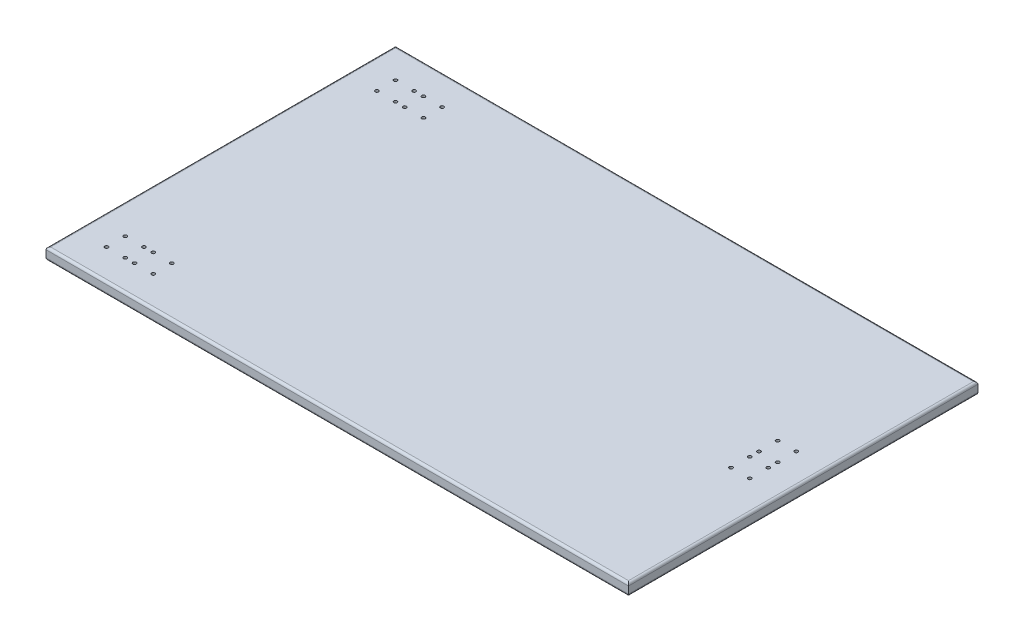
ISO-10303-21;
HEADER;
FILE_DESCRIPTION(('STEP AP214'),'2;1');
FILE_NAME('part.step','',(''),(''),'','','');
FILE_SCHEMA(('AUTOMOTIVE_DESIGN { 1 0 10303 214 1 1 1 1 }'));
ENDSEC;
DATA;
#1=APPLICATION_CONTEXT('core data for automotive mechanical design processes');
#2=APPLICATION_PROTOCOL_DEFINITION('international standard','automotive_design',2000,#1);
#3=PRODUCT_CONTEXT('',#1,'mechanical');
#4=PRODUCT('Part','Part','',(#3));
#5=PRODUCT_RELATED_PRODUCT_CATEGORY('part','',(#4));
#6=PRODUCT_DEFINITION_FORMATION('','',#4);
#7=PRODUCT_DEFINITION_CONTEXT('part definition',#1,'design');
#8=PRODUCT_DEFINITION('design','',#6,#7);
#9=PRODUCT_DEFINITION_SHAPE('','',#8);
#10=(LENGTH_UNIT() NAMED_UNIT(*) SI_UNIT(.MILLI.,.METRE.));
#11=(NAMED_UNIT(*) PLANE_ANGLE_UNIT() SI_UNIT($,.RADIAN.));
#12=(NAMED_UNIT(*) SI_UNIT($,.STERADIAN.) SOLID_ANGLE_UNIT());
#13=UNCERTAINTY_MEASURE_WITH_UNIT(LENGTH_MEASURE(1.E-05),#10,'distance_accuracy_value','');
#14=(GEOMETRIC_REPRESENTATION_CONTEXT(3) GLOBAL_UNCERTAINTY_ASSIGNED_CONTEXT((#13)) GLOBAL_UNIT_ASSIGNED_CONTEXT((#10,
#11,#12)) REPRESENTATION_CONTEXT('',''));
#15=CARTESIAN_POINT('',(0.,0.,0.));
#16=DIRECTION('',(0.,0.,1.));
#17=DIRECTION('',(1.,0.,0.));
#18=AXIS2_PLACEMENT_3D('',#15,#16,#17);
#19=CARTESIAN_POINT('',(-1250.,50.,750.));
#20=DIRECTION('',(1.,0.,0.));
#21=DIRECTION('',(0.,0.,-1.));
#22=AXIS2_PLACEMENT_3D('',#19,#20,#21);
#23=PLANE('',#22);
#24=DIRECTION('',(0.,-1.,0.));
#25=VECTOR('',#24,1.);
#26=CARTESIAN_POINT('',(-1250.,50.,-750.));
#27=LINE('',#26,#25);
#28=CARTESIAN_POINT('',(-1250.,40.,-750.));
#29=VERTEX_POINT('',#28);
#30=CARTESIAN_POINT('',(-1250.,10.,-750.));
#31=VERTEX_POINT('',#30);
#32=EDGE_CURVE('E145',#29,#31,#27,.T.);
#33=ORIENTED_EDGE('',*,*,#32,.T.);
#34=DIRECTION('',(0.,0.,1.));
#35=VECTOR('',#34,1.);
#36=CARTESIAN_POINT('',(-1250.,10.,750.));
#37=LINE('',#36,#35);
#38=CARTESIAN_POINT('',(-1250.,10.,750.));
#39=VERTEX_POINT('',#38);
#40=EDGE_CURVE('E11',#31,#39,#37,.T.);
#41=ORIENTED_EDGE('',*,*,#40,.T.);
#42=DIRECTION('',(0.,-1.,0.));
#43=VECTOR('',#42,1.);
#44=CARTESIAN_POINT('',(-1250.,50.,750.));
#45=LINE('',#44,#43);
#46=CARTESIAN_POINT('',(-1250.,40.,750.));
#47=VERTEX_POINT('',#46);
#48=EDGE_CURVE('E122',#47,#39,#45,.T.);
#49=ORIENTED_EDGE('',*,*,#48,.F.);
#50=DIRECTION('',(0.,0.,1.));
#51=VECTOR('',#50,1.);
#52=CARTESIAN_POINT('',(-1250.,40.,-750.));
#53=LINE('',#52,#51);
#54=EDGE_CURVE('E137',#47,#29,#53,.F.);
#55=ORIENTED_EDGE('',*,*,#54,.T.);
#56=EDGE_LOOP('',(#33,#41,#49,#55));
#57=FACE_BOUND('',#56,.T.);
#58=ADVANCED_FACE('F34',(#57),#23,.F.);
#59=CARTESIAN_POINT('',(1250.,50.,750.));
#60=DIRECTION('',(0.,0.,-1.));
#61=DIRECTION('',(-1.,0.,0.));
#62=AXIS2_PLACEMENT_3D('',#59,#60,#61);
#63=PLANE('',#62);
#64=ORIENTED_EDGE('',*,*,#48,.T.);
#65=DIRECTION('',(1.,0.,0.));
#66=VECTOR('',#65,1.);
#67=CARTESIAN_POINT('',(1250.,10.,750.));
#68=LINE('',#67,#66);
#69=CARTESIAN_POINT('',(1250.,10.,750.));
#70=VERTEX_POINT('',#69);
#71=EDGE_CURVE('E138',#39,#70,#68,.T.);
#72=ORIENTED_EDGE('',*,*,#71,.T.);
#73=DIRECTION('',(0.,-1.,0.));
#74=VECTOR('',#73,1.);
#75=CARTESIAN_POINT('',(1250.,50.,750.));
#76=LINE('',#75,#74);
#77=CARTESIAN_POINT('',(1250.,40.,750.));
#78=VERTEX_POINT('',#77);
#79=EDGE_CURVE('E189',#78,#70,#76,.T.);
#80=ORIENTED_EDGE('',*,*,#79,.F.);
#81=DIRECTION('',(1.,0.,0.));
#82=VECTOR('',#81,1.);
#83=CARTESIAN_POINT('',(-1250.,40.,750.));
#84=LINE('',#83,#82);
#85=EDGE_CURVE('E135',#78,#47,#84,.F.);
#86=ORIENTED_EDGE('',*,*,#85,.T.);
#87=EDGE_LOOP('',(#64,#72,#80,#86));
#88=FACE_BOUND('',#87,.T.);
#89=ADVANCED_FACE('F188',(#88),#63,.F.);
#90=CARTESIAN_POINT('',(1250.,50.,750.));
#91=DIRECTION('',(-1.,0.,0.));
#92=DIRECTION('',(0.,0.,1.));
#93=AXIS2_PLACEMENT_3D('',#90,#91,#92);
#94=PLANE('',#93);
#95=ORIENTED_EDGE('',*,*,#79,.T.);
#96=DIRECTION('',(0.,0.,-1.));
#97=VECTOR('',#96,1.);
#98=CARTESIAN_POINT('',(1250.,10.,750.));
#99=LINE('',#98,#97);
#100=CARTESIAN_POINT('',(1250.,10.,-750.));
#101=VERTEX_POINT('',#100);
#102=EDGE_CURVE('E58',#70,#101,#99,.T.);
#103=ORIENTED_EDGE('',*,*,#102,.T.);
#104=DIRECTION('',(0.,-1.,0.));
#105=VECTOR('',#104,1.);
#106=CARTESIAN_POINT('',(1250.,50.,-750.));
#107=LINE('',#106,#105);
#108=CARTESIAN_POINT('',(1250.,40.,-750.));
#109=VERTEX_POINT('',#108);
#110=EDGE_CURVE('E194',#109,#101,#107,.T.);
#111=ORIENTED_EDGE('',*,*,#110,.F.);
#112=DIRECTION('',(0.,0.,-1.));
#113=VECTOR('',#112,1.);
#114=CARTESIAN_POINT('',(1250.,40.,750.));
#115=LINE('',#114,#113);
#116=EDGE_CURVE('E129',#109,#78,#115,.F.);
#117=ORIENTED_EDGE('',*,*,#116,.T.);
#118=EDGE_LOOP('',(#95,#103,#111,#117));
#119=FACE_BOUND('',#118,.T.);
#120=ADVANCED_FACE('F192',(#119),#94,.F.);
#121=CARTESIAN_POINT('',(1250.,50.,-750.));
#122=DIRECTION('',(0.,0.,1.));
#123=DIRECTION('',(1.,0.,0.));
#124=AXIS2_PLACEMENT_3D('',#121,#122,#123);
#125=PLANE('',#124);
#126=ORIENTED_EDGE('',*,*,#110,.T.);
#127=DIRECTION('',(-1.,0.,0.));
#128=VECTOR('',#127,1.);
#129=CARTESIAN_POINT('',(1250.,10.,-750.));
#130=LINE('',#129,#128);
#131=EDGE_CURVE('E43',#101,#31,#130,.T.);
#132=ORIENTED_EDGE('',*,*,#131,.T.);
#133=ORIENTED_EDGE('',*,*,#32,.F.);
#134=DIRECTION('',(-1.,0.,0.));
#135=VECTOR('',#134,1.);
#136=CARTESIAN_POINT('',(1250.,40.,-750.));
#137=LINE('',#136,#135);
#138=EDGE_CURVE('E109',#29,#109,#137,.F.);
#139=ORIENTED_EDGE('',*,*,#138,.T.);
#140=EDGE_LOOP('',(#126,#132,#133,#139));
#141=FACE_BOUND('',#140,.T.);
#142=ADVANCED_FACE('F204',(#141),#125,.F.);
#143=CARTESIAN_POINT('',(0.,50.,0.));
#144=DIRECTION('',(0.,1.,0.));
#145=DIRECTION('',(0.,0.,1.));
#146=AXIS2_PLACEMENT_3D('',#143,#144,#145);
#147=PLANE('',#146);
#148=CARTESIAN_POINT('',(-919.999999999999,50.,620.));
#149=DIRECTION('',(0.,-1.,0.));
#150=DIRECTION('',(0.,0.,-1.));
#151=AXIS2_PLACEMENT_3D('',#148,#149,#150);
#152=CIRCLE('',#151,7.24999999999993);
#153=CARTESIAN_POINT('',(-919.999999999999,50.,612.75));
#154=VERTEX_POINT('',#153);
#155=EDGE_CURVE('E288',#154,#154,#152,.T.);
#156=ORIENTED_EDGE('',*,*,#155,.T.);
#157=EDGE_LOOP('',(#156));
#158=FACE_BOUND('',#157,.T.);
#159=CARTESIAN_POINT('',(-919.999999999999,50.,-540.));
#160=DIRECTION('',(0.,-1.,0.));
#161=DIRECTION('',(0.,0.,-1.));
#162=AXIS2_PLACEMENT_3D('',#159,#160,#161);
#163=CIRCLE('',#162,7.24999999999993);
#164=CARTESIAN_POINT('',(-919.999999999999,50.,-547.25));
#165=VERTEX_POINT('',#164);
#166=EDGE_CURVE('E295',#165,#165,#163,.T.);
#167=ORIENTED_EDGE('',*,*,#166,.T.);
#168=EDGE_LOOP('',(#167));
#169=FACE_BOUND('',#168,.T.);
#170=CARTESIAN_POINT('',(-1000.,50.,-540.));
#171=DIRECTION('',(0.,-1.,0.));
#172=DIRECTION('',(0.,0.,1.));
#173=AXIS2_PLACEMENT_3D('',#170,#171,#172);
#174=CIRCLE('',#173,7.24999999999993);
#175=CARTESIAN_POINT('',(-1000.,50.,-532.75));
#176=VERTEX_POINT('',#175);
#177=EDGE_CURVE('E301',#176,#176,#174,.T.);
#178=ORIENTED_EDGE('',*,*,#177,.T.);
#179=EDGE_LOOP('',(#178));
#180=FACE_BOUND('',#179,.T.);
#181=CARTESIAN_POINT('',(-1000.,50.,-620.));
#182=DIRECTION('',(0.,-1.,0.));
#183=DIRECTION('',(0.,0.,-1.));
#184=AXIS2_PLACEMENT_3D('',#181,#182,#183);
#185=CIRCLE('',#184,7.24999999999993);
#186=CARTESIAN_POINT('',(-1000.,50.,-627.25));
#187=VERTEX_POINT('',#186);
#188=EDGE_CURVE('E277',#187,#187,#185,.T.);
#189=ORIENTED_EDGE('',*,*,#188,.T.);
#190=EDGE_LOOP('',(#189));
#191=FACE_BOUND('',#190,.T.);
#192=CARTESIAN_POINT('',(-1040.,50.,-620.));
#193=DIRECTION('',(0.,-1.,0.));
#194=DIRECTION('',(0.,0.,1.));
#195=AXIS2_PLACEMENT_3D('',#192,#193,#194);
#196=CIRCLE('',#195,7.24999999999993);
#197=CARTESIAN_POINT('',(-1040.,50.,-612.75));
#198=VERTEX_POINT('',#197);
#199=EDGE_CURVE('E258',#198,#198,#196,.T.);
#200=ORIENTED_EDGE('',*,*,#199,.T.);
#201=EDGE_LOOP('',(#200));
#202=FACE_BOUND('',#201,.T.);
#203=CARTESIAN_POINT('',(-1040.,50.,-540.));
#204=DIRECTION('',(0.,-1.,0.));
#205=DIRECTION('',(0.,0.,-1.));
#206=AXIS2_PLACEMENT_3D('',#203,#204,#205);
#207=CIRCLE('',#206,7.24999999999993);
#208=CARTESIAN_POINT('',(-1040.,50.,-547.25));
#209=VERTEX_POINT('',#208);
#210=EDGE_CURVE('E264',#209,#209,#207,.T.);
#211=ORIENTED_EDGE('',*,*,#210,.T.);
#212=EDGE_LOOP('',(#211));
#213=FACE_BOUND('',#212,.T.);
#214=CARTESIAN_POINT('',(-1120.,50.,-540.));
#215=DIRECTION('',(0.,-1.,0.));
#216=DIRECTION('',(0.,0.,1.));
#217=AXIS2_PLACEMENT_3D('',#214,#215,#216);
#218=CIRCLE('',#217,7.24999999999993);
#219=CARTESIAN_POINT('',(-1120.,50.,-532.75));
#220=VERTEX_POINT('',#219);
#221=EDGE_CURVE('E265',#220,#220,#218,.T.);
#222=ORIENTED_EDGE('',*,*,#221,.T.);
#223=EDGE_LOOP('',(#222));
#224=FACE_BOUND('',#223,.T.);
#225=CARTESIAN_POINT('',(-919.999999999999,50.,-620.));
#226=DIRECTION('',(0.,-1.,0.));
#227=DIRECTION('',(0.,0.,1.));
#228=AXIS2_PLACEMENT_3D('',#225,#226,#227);
#229=CIRCLE('',#228,7.24999999999993);
#230=CARTESIAN_POINT('',(-919.999999999999,50.,-612.75));
#231=VERTEX_POINT('',#230);
#232=EDGE_CURVE('E276',#231,#231,#229,.T.);
#233=ORIENTED_EDGE('',*,*,#232,.T.);
#234=EDGE_LOOP('',(#233));
#235=FACE_BOUND('',#234,.T.);
#236=CARTESIAN_POINT('',(-1120.,50.,620.));
#237=DIRECTION('',(0.,-1.,0.));
#238=DIRECTION('',(0.,0.,1.));
#239=AXIS2_PLACEMENT_3D('',#236,#237,#238);
#240=CIRCLE('',#239,7.24999999999993);
#241=CARTESIAN_POINT('',(-1120.,50.,627.25));
#242=VERTEX_POINT('',#241);
#243=EDGE_CURVE('E336',#242,#242,#240,.T.);
#244=ORIENTED_EDGE('',*,*,#243,.T.);
#245=EDGE_LOOP('',(#244));
#246=FACE_BOUND('',#245,.T.);
#247=CARTESIAN_POINT('',(-1120.,50.,540.));
#248=DIRECTION('',(0.,-1.,0.));
#249=DIRECTION('',(0.,0.,-1.));
#250=AXIS2_PLACEMENT_3D('',#247,#248,#249);
#251=CIRCLE('',#250,7.24999999999993);
#252=CARTESIAN_POINT('',(-1120.,50.,532.75));
#253=VERTEX_POINT('',#252);
#254=EDGE_CURVE('E342',#253,#253,#251,.T.);
#255=ORIENTED_EDGE('',*,*,#254,.T.);
#256=EDGE_LOOP('',(#255));
#257=FACE_BOUND('',#256,.T.);
#258=CARTESIAN_POINT('',(-1040.,50.,540.));
#259=DIRECTION('',(0.,-1.,0.));
#260=DIRECTION('',(0.,0.,1.));
#261=AXIS2_PLACEMENT_3D('',#258,#259,#260);
#262=CIRCLE('',#261,7.24999999999993);
#263=CARTESIAN_POINT('',(-1040.,50.,547.25));
#264=VERTEX_POINT('',#263);
#265=EDGE_CURVE('E313',#264,#264,#262,.T.);
#266=ORIENTED_EDGE('',*,*,#265,.T.);
#267=EDGE_LOOP('',(#266));
#268=FACE_BOUND('',#267,.T.);
#269=CARTESIAN_POINT('',(-1040.,50.,620.));
#270=DIRECTION('',(0.,-1.,0.));
#271=DIRECTION('',(0.,0.,-1.));
#272=AXIS2_PLACEMENT_3D('',#269,#270,#271);
#273=CIRCLE('',#272,7.24999999999993);
#274=CARTESIAN_POINT('',(-1040.,50.,612.75));
#275=VERTEX_POINT('',#274);
#276=EDGE_CURVE('E312',#275,#275,#273,.T.);
#277=ORIENTED_EDGE('',*,*,#276,.T.);
#278=EDGE_LOOP('',(#277));
#279=FACE_BOUND('',#278,.T.);
#280=CARTESIAN_POINT('',(-1000.,50.,620.));
#281=DIRECTION('',(0.,-1.,0.));
#282=DIRECTION('',(0.,0.,1.));
#283=AXIS2_PLACEMENT_3D('',#280,#281,#282);
#284=CIRCLE('',#283,7.24999999999993);
#285=CARTESIAN_POINT('',(-1000.,50.,627.25));
#286=VERTEX_POINT('',#285);
#287=EDGE_CURVE('E319',#286,#286,#284,.T.);
#288=ORIENTED_EDGE('',*,*,#287,.T.);
#289=EDGE_LOOP('',(#288));
#290=FACE_BOUND('',#289,.T.);
#291=CARTESIAN_POINT('',(-1000.,50.,540.));
#292=DIRECTION('',(0.,-1.,0.));
#293=DIRECTION('',(0.,0.,-1.));
#294=AXIS2_PLACEMENT_3D('',#291,#292,#293);
#295=CIRCLE('',#294,7.24999999999993);
#296=CARTESIAN_POINT('',(-1000.,50.,532.75));
#297=VERTEX_POINT('',#296);
#298=EDGE_CURVE('E325',#297,#297,#295,.T.);
#299=ORIENTED_EDGE('',*,*,#298,.T.);
#300=EDGE_LOOP('',(#299));
#301=FACE_BOUND('',#300,.T.);
#302=CARTESIAN_POINT('',(-919.999999999999,50.,540.));
#303=DIRECTION('',(0.,-1.,0.));
#304=DIRECTION('',(0.,0.,1.));
#305=AXIS2_PLACEMENT_3D('',#302,#303,#304);
#306=CIRCLE('',#305,7.24999999999993);
#307=CARTESIAN_POINT('',(-919.999999999999,50.,547.25));
#308=VERTEX_POINT('',#307);
#309=EDGE_CURVE('E289',#308,#308,#306,.T.);
#310=ORIENTED_EDGE('',*,*,#309,.T.);
#311=EDGE_LOOP('',(#310));
#312=FACE_BOUND('',#311,.T.);
#313=CARTESIAN_POINT('',(-1120.,50.,-620.));
#314=DIRECTION('',(0.,-1.,0.));
#315=DIRECTION('',(0.,0.,-1.));
#316=AXIS2_PLACEMENT_3D('',#313,#314,#315);
#317=CIRCLE('',#316,7.24999999999993);
#318=CARTESIAN_POINT('',(-1120.,50.,-627.25));
#319=VERTEX_POINT('',#318);
#320=EDGE_CURVE('E217',#319,#319,#317,.T.);
#321=ORIENTED_EDGE('',*,*,#320,.T.);
#322=EDGE_LOOP('',(#321));
#323=FACE_BOUND('',#322,.T.);
#324=CARTESIAN_POINT('',(1040.,50.,100.));
#325=DIRECTION('',(0.,-1.,0.));
#326=DIRECTION('',(0.,0.,-1.));
#327=AXIS2_PLACEMENT_3D('',#324,#325,#326);
#328=CIRCLE('',#327,7.24999999999994);
#329=CARTESIAN_POINT('',(1040.,50.,92.7500000000001));
#330=VERTEX_POINT('',#329);
#331=EDGE_CURVE('E216',#330,#330,#328,.T.);
#332=ORIENTED_EDGE('',*,*,#331,.T.);
#333=EDGE_LOOP('',(#332));
#334=FACE_BOUND('',#333,.T.);
#335=CARTESIAN_POINT('',(1040.,50.,20.));
#336=DIRECTION('',(0.,-1.,0.));
#337=DIRECTION('',(0.,0.,1.));
#338=AXIS2_PLACEMENT_3D('',#335,#336,#337);
#339=CIRCLE('',#338,7.24999999999994);
#340=CARTESIAN_POINT('',(1040.,50.,27.2499999999999));
#341=VERTEX_POINT('',#340);
#342=EDGE_CURVE('E223',#341,#341,#339,.T.);
#343=ORIENTED_EDGE('',*,*,#342,.T.);
#344=EDGE_LOOP('',(#343));
#345=FACE_BOUND('',#344,.T.);
#346=CARTESIAN_POINT('',(1120.,50.,20.));
#347=DIRECTION('',(0.,-1.,0.));
#348=DIRECTION('',(0.,0.,-1.));
#349=AXIS2_PLACEMENT_3D('',#346,#347,#348);
#350=CIRCLE('',#349,7.24999999999994);
#351=CARTESIAN_POINT('',(1120.,50.,12.7500000000001));
#352=VERTEX_POINT('',#351);
#353=EDGE_CURVE('E229',#352,#352,#350,.T.);
#354=ORIENTED_EDGE('',*,*,#353,.T.);
#355=EDGE_LOOP('',(#354));
#356=FACE_BOUND('',#355,.T.);
#357=CARTESIAN_POINT('',(1120.,50.,-20.));
#358=DIRECTION('',(0.,-1.,0.));
#359=DIRECTION('',(0.,0.,1.));
#360=AXIS2_PLACEMENT_3D('',#357,#358,#359);
#361=CIRCLE('',#360,7.24999999999994);
#362=CARTESIAN_POINT('',(1120.,50.,-12.7500000000001));
#363=VERTEX_POINT('',#362);
#364=EDGE_CURVE('E235',#363,#363,#361,.T.);
#365=ORIENTED_EDGE('',*,*,#364,.T.);
#366=EDGE_LOOP('',(#365));
#367=FACE_BOUND('',#366,.T.);
#368=CARTESIAN_POINT('',(1040.,50.,-20.));
#369=DIRECTION('',(0.,-1.,0.));
#370=DIRECTION('',(0.,0.,-1.));
#371=AXIS2_PLACEMENT_3D('',#368,#369,#370);
#372=CIRCLE('',#371,7.24999999999994);
#373=CARTESIAN_POINT('',(1040.,50.,-27.2499999999999));
#374=VERTEX_POINT('',#373);
#375=EDGE_CURVE('E241',#374,#374,#372,.T.);
#376=ORIENTED_EDGE('',*,*,#375,.T.);
#377=EDGE_LOOP('',(#376));
#378=FACE_BOUND('',#377,.T.);
#379=CARTESIAN_POINT('',(1040.,50.,-100.));
#380=DIRECTION('',(0.,-1.,0.));
#381=DIRECTION('',(0.,0.,1.));
#382=AXIS2_PLACEMENT_3D('',#379,#380,#381);
#383=CIRCLE('',#382,7.24999999999994);
#384=CARTESIAN_POINT('',(1040.,50.,-92.7500000000001));
#385=VERTEX_POINT('',#384);
#386=EDGE_CURVE('E247',#385,#385,#383,.T.);
#387=ORIENTED_EDGE('',*,*,#386,.T.);
#388=EDGE_LOOP('',(#387));
#389=FACE_BOUND('',#388,.T.);
#390=CARTESIAN_POINT('',(1120.,50.,-100.));
#391=DIRECTION('',(0.,-1.,0.));
#392=DIRECTION('',(0.,0.,-1.));
#393=AXIS2_PLACEMENT_3D('',#390,#391,#392);
#394=CIRCLE('',#393,7.24999999999994);
#395=CARTESIAN_POINT('',(1120.,50.,-107.25));
#396=VERTEX_POINT('',#395);
#397=EDGE_CURVE('E210',#396,#396,#394,.T.);
#398=ORIENTED_EDGE('',*,*,#397,.T.);
#399=EDGE_LOOP('',(#398));
#400=FACE_BOUND('',#399,.T.);
#401=CARTESIAN_POINT('',(1120.,50.,100.));
#402=DIRECTION('',(0.,-1.,0.));
#403=DIRECTION('',(0.,0.,1.));
#404=AXIS2_PLACEMENT_3D('',#401,#402,#403);
#405=CIRCLE('',#404,7.24999999999994);
#406=CARTESIAN_POINT('',(1120.,50.,107.25));
#407=VERTEX_POINT('',#406);
#408=EDGE_CURVE('E162',#407,#407,#405,.T.);
#409=ORIENTED_EDGE('',*,*,#408,.T.);
#410=EDGE_LOOP('',(#409));
#411=FACE_BOUND('',#410,.T.);
#412=DIRECTION('',(0.,0.,-1.));
#413=VECTOR('',#412,1.);
#414=CARTESIAN_POINT('',(1240.,50.,-750.));
#415=LINE('',#414,#413);
#416=CARTESIAN_POINT('',(1240.,50.,740.));
#417=VERTEX_POINT('',#416);
#418=CARTESIAN_POINT('',(1240.,50.,-740.));
#419=VERTEX_POINT('',#418);
#420=EDGE_CURVE('E126',#417,#419,#415,.T.);
#421=ORIENTED_EDGE('',*,*,#420,.T.);
#422=DIRECTION('',(-1.,0.,0.));
#423=VECTOR('',#422,1.);
#424=CARTESIAN_POINT('',(-1250.,50.,-740.));
#425=LINE('',#424,#423);
#426=CARTESIAN_POINT('',(-1240.,50.,-740.));
#427=VERTEX_POINT('',#426);
#428=EDGE_CURVE('E107',#419,#427,#425,.T.);
#429=ORIENTED_EDGE('',*,*,#428,.T.);
#430=DIRECTION('',(0.,0.,1.));
#431=VECTOR('',#430,1.);
#432=CARTESIAN_POINT('',(-1240.,50.,750.));
#433=LINE('',#432,#431);
#434=CARTESIAN_POINT('',(-1240.,50.,740.));
#435=VERTEX_POINT('',#434);
#436=EDGE_CURVE('E115',#427,#435,#433,.T.);
#437=ORIENTED_EDGE('',*,*,#436,.T.);
#438=DIRECTION('',(1.,0.,0.));
#439=VECTOR('',#438,1.);
#440=CARTESIAN_POINT('',(1250.,50.,740.));
#441=LINE('',#440,#439);
#442=EDGE_CURVE('E121',#435,#417,#441,.T.);
#443=ORIENTED_EDGE('',*,*,#442,.T.);
#444=EDGE_LOOP('',(#421,#429,#437,#443));
#445=FACE_BOUND('',#444,.T.);
#446=ADVANCED_FACE('F124',(#158,#169,#180,#191,#202,#213,#224,#235,#246,#257,#268,#279,#290,
#301,#312,#323,#334,#345,#356,#367,#378,#389,#400,#411,#445),#147,.T.);
#447=CARTESIAN_POINT('',(0.,0.,0.));
#448=DIRECTION('',(0.,1.,0.));
#449=DIRECTION('',(0.,0.,1.));
#450=AXIS2_PLACEMENT_3D('',#447,#448,#449);
#451=PLANE('',#450);
#452=CARTESIAN_POINT('',(-919.999999999999,0.,620.));
#453=DIRECTION('',(0.,-1.,0.));
#454=DIRECTION('',(0.,0.,-1.));
#455=AXIS2_PLACEMENT_3D('',#452,#453,#454);
#456=CIRCLE('',#455,7.24999999999993);
#457=CARTESIAN_POINT('',(-919.999999999999,0.,612.75));
#458=VERTEX_POINT('',#457);
#459=EDGE_CURVE('E285',#458,#458,#456,.T.);
#460=ORIENTED_EDGE('',*,*,#459,.F.);
#461=EDGE_LOOP('',(#460));
#462=FACE_BOUND('',#461,.T.);
#463=CARTESIAN_POINT('',(-919.999999999999,0.,-540.));
#464=DIRECTION('',(0.,-1.,0.));
#465=DIRECTION('',(0.,0.,-1.));
#466=AXIS2_PLACEMENT_3D('',#463,#464,#465);
#467=CIRCLE('',#466,7.24999999999993);
#468=CARTESIAN_POINT('',(-919.999999999999,0.,-547.25));
#469=VERTEX_POINT('',#468);
#470=EDGE_CURVE('E292',#469,#469,#467,.T.);
#471=ORIENTED_EDGE('',*,*,#470,.F.);
#472=EDGE_LOOP('',(#471));
#473=FACE_BOUND('',#472,.T.);
#474=CARTESIAN_POINT('',(-1000.,0.,-540.));
#475=DIRECTION('',(0.,-1.,0.));
#476=DIRECTION('',(0.,0.,1.));
#477=AXIS2_PLACEMENT_3D('',#474,#475,#476);
#478=CIRCLE('',#477,7.24999999999993);
#479=CARTESIAN_POINT('',(-1000.,0.,-532.75));
#480=VERTEX_POINT('',#479);
#481=EDGE_CURVE('E298',#480,#480,#478,.T.);
#482=ORIENTED_EDGE('',*,*,#481,.F.);
#483=EDGE_LOOP('',(#482));
#484=FACE_BOUND('',#483,.T.);
#485=CARTESIAN_POINT('',(-1000.,0.,-620.));
#486=DIRECTION('',(0.,-1.,0.));
#487=DIRECTION('',(0.,0.,-1.));
#488=AXIS2_PLACEMENT_3D('',#485,#486,#487);
#489=CIRCLE('',#488,7.24999999999993);
#490=CARTESIAN_POINT('',(-1000.,0.,-627.25));
#491=VERTEX_POINT('',#490);
#492=EDGE_CURVE('E304',#491,#491,#489,.T.);
#493=ORIENTED_EDGE('',*,*,#492,.F.);
#494=EDGE_LOOP('',(#493));
#495=FACE_BOUND('',#494,.T.);
#496=CARTESIAN_POINT('',(-1040.,0.,-620.));
#497=DIRECTION('',(0.,-1.,0.));
#498=DIRECTION('',(0.,0.,1.));
#499=AXIS2_PLACEMENT_3D('',#496,#497,#498);
#500=CIRCLE('',#499,7.24999999999993);
#501=CARTESIAN_POINT('',(-1040.,0.,-612.75));
#502=VERTEX_POINT('',#501);
#503=EDGE_CURVE('E268',#502,#502,#500,.T.);
#504=ORIENTED_EDGE('',*,*,#503,.F.);
#505=EDGE_LOOP('',(#504));
#506=FACE_BOUND('',#505,.T.);
#507=CARTESIAN_POINT('',(-1040.,0.,-540.));
#508=DIRECTION('',(0.,-1.,0.));
#509=DIRECTION('',(0.,0.,-1.));
#510=AXIS2_PLACEMENT_3D('',#507,#508,#509);
#511=CIRCLE('',#510,7.24999999999993);
#512=CARTESIAN_POINT('',(-1040.,0.,-547.25));
#513=VERTEX_POINT('',#512);
#514=EDGE_CURVE('E261',#513,#513,#511,.T.);
#515=ORIENTED_EDGE('',*,*,#514,.F.);
#516=EDGE_LOOP('',(#515));
#517=FACE_BOUND('',#516,.T.);
#518=CARTESIAN_POINT('',(-1120.,0.,-540.));
#519=DIRECTION('',(0.,-1.,0.));
#520=DIRECTION('',(0.,0.,1.));
#521=AXIS2_PLACEMENT_3D('',#518,#519,#520);
#522=CIRCLE('',#521,7.24999999999993);
#523=CARTESIAN_POINT('',(-1120.,0.,-532.75));
#524=VERTEX_POINT('',#523);
#525=EDGE_CURVE('E280',#524,#524,#522,.T.);
#526=ORIENTED_EDGE('',*,*,#525,.F.);
#527=EDGE_LOOP('',(#526));
#528=FACE_BOUND('',#527,.T.);
#529=CARTESIAN_POINT('',(-919.999999999999,0.,-620.));
#530=DIRECTION('',(0.,-1.,0.));
#531=DIRECTION('',(0.,0.,1.));
#532=AXIS2_PLACEMENT_3D('',#529,#530,#531);
#533=CIRCLE('',#532,7.24999999999993);
#534=CARTESIAN_POINT('',(-919.999999999999,0.,-612.75));
#535=VERTEX_POINT('',#534);
#536=EDGE_CURVE('E273',#535,#535,#533,.T.);
#537=ORIENTED_EDGE('',*,*,#536,.F.);
#538=EDGE_LOOP('',(#537));
#539=FACE_BOUND('',#538,.T.);
#540=CARTESIAN_POINT('',(-1120.,0.,620.));
#541=DIRECTION('',(0.,-1.,0.));
#542=DIRECTION('',(0.,0.,1.));
#543=AXIS2_PLACEMENT_3D('',#540,#541,#542);
#544=CIRCLE('',#543,7.24999999999993);
#545=CARTESIAN_POINT('',(-1120.,0.,627.25));
#546=VERTEX_POINT('',#545);
#547=EDGE_CURVE('E333',#546,#546,#544,.T.);
#548=ORIENTED_EDGE('',*,*,#547,.F.);
#549=EDGE_LOOP('',(#548));
#550=FACE_BOUND('',#549,.T.);
#551=CARTESIAN_POINT('',(-1120.,0.,540.));
#552=DIRECTION('',(0.,-1.,0.));
#553=DIRECTION('',(0.,0.,-1.));
#554=AXIS2_PLACEMENT_3D('',#551,#552,#553);
#555=CIRCLE('',#554,7.24999999999993);
#556=CARTESIAN_POINT('',(-1120.,0.,532.75));
#557=VERTEX_POINT('',#556);
#558=EDGE_CURVE('E339',#557,#557,#555,.T.);
#559=ORIENTED_EDGE('',*,*,#558,.F.);
#560=EDGE_LOOP('',(#559));
#561=FACE_BOUND('',#560,.T.);
#562=CARTESIAN_POINT('',(-1040.,0.,540.));
#563=DIRECTION('',(0.,-1.,0.));
#564=DIRECTION('',(0.,0.,1.));
#565=AXIS2_PLACEMENT_3D('',#562,#563,#564);
#566=CIRCLE('',#565,7.24999999999993);
#567=CARTESIAN_POINT('',(-1040.,0.,547.25));
#568=VERTEX_POINT('',#567);
#569=EDGE_CURVE('E345',#568,#568,#566,.T.);
#570=ORIENTED_EDGE('',*,*,#569,.F.);
#571=EDGE_LOOP('',(#570));
#572=FACE_BOUND('',#571,.T.);
#573=CARTESIAN_POINT('',(-1040.,0.,620.));
#574=DIRECTION('',(0.,-1.,0.));
#575=DIRECTION('',(0.,0.,-1.));
#576=AXIS2_PLACEMENT_3D('',#573,#574,#575);
#577=CIRCLE('',#576,7.24999999999993);
#578=CARTESIAN_POINT('',(-1040.,0.,612.75));
#579=VERTEX_POINT('',#578);
#580=EDGE_CURVE('E309',#579,#579,#577,.T.);
#581=ORIENTED_EDGE('',*,*,#580,.F.);
#582=EDGE_LOOP('',(#581));
#583=FACE_BOUND('',#582,.T.);
#584=CARTESIAN_POINT('',(-1000.,0.,620.));
#585=DIRECTION('',(0.,-1.,0.));
#586=DIRECTION('',(0.,0.,1.));
#587=AXIS2_PLACEMENT_3D('',#584,#585,#586);
#588=CIRCLE('',#587,7.24999999999993);
#589=CARTESIAN_POINT('',(-1000.,0.,627.25));
#590=VERTEX_POINT('',#589);
#591=EDGE_CURVE('E316',#590,#590,#588,.T.);
#592=ORIENTED_EDGE('',*,*,#591,.F.);
#593=EDGE_LOOP('',(#592));
#594=FACE_BOUND('',#593,.T.);
#595=CARTESIAN_POINT('',(-1000.,0.,540.));
#596=DIRECTION('',(0.,-1.,0.));
#597=DIRECTION('',(0.,0.,-1.));
#598=AXIS2_PLACEMENT_3D('',#595,#596,#597);
#599=CIRCLE('',#598,7.24999999999993);
#600=CARTESIAN_POINT('',(-1000.,0.,532.75));
#601=VERTEX_POINT('',#600);
#602=EDGE_CURVE('E322',#601,#601,#599,.T.);
#603=ORIENTED_EDGE('',*,*,#602,.F.);
#604=EDGE_LOOP('',(#603));
#605=FACE_BOUND('',#604,.T.);
#606=CARTESIAN_POINT('',(-919.999999999999,0.,540.));
#607=DIRECTION('',(0.,-1.,0.));
#608=DIRECTION('',(0.,0.,1.));
#609=AXIS2_PLACEMENT_3D('',#606,#607,#608);
#610=CIRCLE('',#609,7.24999999999993);
#611=CARTESIAN_POINT('',(-919.999999999999,0.,547.25));
#612=VERTEX_POINT('',#611);
#613=EDGE_CURVE('E328',#612,#612,#610,.T.);
#614=ORIENTED_EDGE('',*,*,#613,.F.);
#615=EDGE_LOOP('',(#614));
#616=FACE_BOUND('',#615,.T.);
#617=CARTESIAN_POINT('',(-1120.,0.,-620.));
#618=DIRECTION('',(0.,-1.,0.));
#619=DIRECTION('',(0.,0.,-1.));
#620=AXIS2_PLACEMENT_3D('',#617,#618,#619);
#621=CIRCLE('',#620,7.24999999999993);
#622=CARTESIAN_POINT('',(-1120.,0.,-627.25));
#623=VERTEX_POINT('',#622);
#624=EDGE_CURVE('E255',#623,#623,#621,.T.);
#625=ORIENTED_EDGE('',*,*,#624,.F.);
#626=EDGE_LOOP('',(#625));
#627=FACE_BOUND('',#626,.T.);
#628=CARTESIAN_POINT('',(1040.,0.,100.));
#629=DIRECTION('',(0.,-1.,0.));
#630=DIRECTION('',(0.,0.,-1.));
#631=AXIS2_PLACEMENT_3D('',#628,#629,#630);
#632=CIRCLE('',#631,7.24999999999994);
#633=CARTESIAN_POINT('',(1040.,0.,92.7500000000001));
#634=VERTEX_POINT('',#633);
#635=EDGE_CURVE('E213',#634,#634,#632,.T.);
#636=ORIENTED_EDGE('',*,*,#635,.F.);
#637=EDGE_LOOP('',(#636));
#638=FACE_BOUND('',#637,.T.);
#639=CARTESIAN_POINT('',(1040.,0.,20.));
#640=DIRECTION('',(0.,-1.,0.));
#641=DIRECTION('',(0.,0.,1.));
#642=AXIS2_PLACEMENT_3D('',#639,#640,#641);
#643=CIRCLE('',#642,7.24999999999994);
#644=CARTESIAN_POINT('',(1040.,0.,27.2499999999999));
#645=VERTEX_POINT('',#644);
#646=EDGE_CURVE('E220',#645,#645,#643,.T.);
#647=ORIENTED_EDGE('',*,*,#646,.F.);
#648=EDGE_LOOP('',(#647));
#649=FACE_BOUND('',#648,.T.);
#650=CARTESIAN_POINT('',(1120.,0.,20.));
#651=DIRECTION('',(0.,-1.,0.));
#652=DIRECTION('',(0.,0.,-1.));
#653=AXIS2_PLACEMENT_3D('',#650,#651,#652);
#654=CIRCLE('',#653,7.24999999999994);
#655=CARTESIAN_POINT('',(1120.,0.,12.7500000000001));
#656=VERTEX_POINT('',#655);
#657=EDGE_CURVE('E226',#656,#656,#654,.T.);
#658=ORIENTED_EDGE('',*,*,#657,.F.);
#659=EDGE_LOOP('',(#658));
#660=FACE_BOUND('',#659,.T.);
#661=CARTESIAN_POINT('',(1120.,0.,-20.));
#662=DIRECTION('',(0.,-1.,0.));
#663=DIRECTION('',(0.,0.,1.));
#664=AXIS2_PLACEMENT_3D('',#661,#662,#663);
#665=CIRCLE('',#664,7.24999999999994);
#666=CARTESIAN_POINT('',(1120.,0.,-12.7500000000001));
#667=VERTEX_POINT('',#666);
#668=EDGE_CURVE('E232',#667,#667,#665,.T.);
#669=ORIENTED_EDGE('',*,*,#668,.F.);
#670=EDGE_LOOP('',(#669));
#671=FACE_BOUND('',#670,.T.);
#672=CARTESIAN_POINT('',(1040.,0.,-20.));
#673=DIRECTION('',(0.,-1.,0.));
#674=DIRECTION('',(0.,0.,-1.));
#675=AXIS2_PLACEMENT_3D('',#672,#673,#674);
#676=CIRCLE('',#675,7.24999999999994);
#677=CARTESIAN_POINT('',(1040.,0.,-27.2499999999999));
#678=VERTEX_POINT('',#677);
#679=EDGE_CURVE('E238',#678,#678,#676,.T.);
#680=ORIENTED_EDGE('',*,*,#679,.F.);
#681=EDGE_LOOP('',(#680));
#682=FACE_BOUND('',#681,.T.);
#683=CARTESIAN_POINT('',(1040.,0.,-100.));
#684=DIRECTION('',(0.,-1.,0.));
#685=DIRECTION('',(0.,0.,1.));
#686=AXIS2_PLACEMENT_3D('',#683,#684,#685);
#687=CIRCLE('',#686,7.24999999999994);
#688=CARTESIAN_POINT('',(1040.,0.,-92.7500000000001));
#689=VERTEX_POINT('',#688);
#690=EDGE_CURVE('E244',#689,#689,#687,.T.);
#691=ORIENTED_EDGE('',*,*,#690,.F.);
#692=EDGE_LOOP('',(#691));
#693=FACE_BOUND('',#692,.T.);
#694=CARTESIAN_POINT('',(1120.,0.,-100.));
#695=DIRECTION('',(0.,-1.,0.));
#696=DIRECTION('',(0.,0.,-1.));
#697=AXIS2_PLACEMENT_3D('',#694,#695,#696);
#698=CIRCLE('',#697,7.24999999999994);
#699=CARTESIAN_POINT('',(1120.,0.,-107.25));
#700=VERTEX_POINT('',#699);
#701=EDGE_CURVE('E250',#700,#700,#698,.T.);
#702=ORIENTED_EDGE('',*,*,#701,.F.);
#703=EDGE_LOOP('',(#702));
#704=FACE_BOUND('',#703,.T.);
#705=CARTESIAN_POINT('',(1120.,0.,100.));
#706=DIRECTION('',(0.,-1.,0.));
#707=DIRECTION('',(0.,0.,1.));
#708=AXIS2_PLACEMENT_3D('',#705,#706,#707);
#709=CIRCLE('',#708,7.24999999999994);
#710=CARTESIAN_POINT('',(1120.,0.,107.25));
#711=VERTEX_POINT('',#710);
#712=EDGE_CURVE('E207',#711,#711,#709,.T.);
#713=ORIENTED_EDGE('',*,*,#712,.F.);
#714=EDGE_LOOP('',(#713));
#715=FACE_BOUND('',#714,.T.);
#716=DIRECTION('',(0.,0.,-1.));
#717=VECTOR('',#716,1.);
#718=CARTESIAN_POINT('',(1240.,0.,1.83556873404693E-13));
#719=LINE('',#718,#717);
#720=CARTESIAN_POINT('',(1240.,0.,-740.));
#721=VERTEX_POINT('',#720);
#722=CARTESIAN_POINT('',(1240.,0.,740.));
#723=VERTEX_POINT('',#722);
#724=EDGE_CURVE('E152',#721,#723,#719,.F.);
#725=ORIENTED_EDGE('',*,*,#724,.T.);
#726=DIRECTION('',(1.,0.,0.));
#727=VECTOR('',#726,1.);
#728=CARTESIAN_POINT('',(0.,0.,740.));
#729=LINE('',#728,#727);
#730=CARTESIAN_POINT('',(-1240.,0.,740.));
#731=VERTEX_POINT('',#730);
#732=EDGE_CURVE('E154',#723,#731,#729,.F.);
#733=ORIENTED_EDGE('',*,*,#732,.T.);
#734=DIRECTION('',(0.,0.,1.));
#735=VECTOR('',#734,1.);
#736=CARTESIAN_POINT('',(-1240.,0.,0.));
#737=LINE('',#736,#735);
#738=CARTESIAN_POINT('',(-1240.,0.,-740.));
#739=VERTEX_POINT('',#738);
#740=EDGE_CURVE('E148',#731,#739,#737,.F.);
#741=ORIENTED_EDGE('',*,*,#740,.T.);
#742=DIRECTION('',(-1.,0.,0.));
#743=VECTOR('',#742,1.);
#744=CARTESIAN_POINT('',(0.,0.,-740.));
#745=LINE('',#744,#743);
#746=EDGE_CURVE('E150',#739,#721,#745,.F.);
#747=ORIENTED_EDGE('',*,*,#746,.T.);
#748=EDGE_LOOP('',(#725,#733,#741,#747));
#749=FACE_BOUND('',#748,.T.);
#750=ADVANCED_FACE('F178',(#462,#473,#484,#495,#506,#517,#528,#539,#550,#561,#572,#583,#594,
#605,#616,#627,#638,#649,#660,#671,#682,#693,#704,#715,#749),#451,.F.);
#751=CARTESIAN_POINT('',(0.,40.,740.));
#752=DIRECTION('',(-1.,0.,0.));
#753=DIRECTION('',(0.,0.,1.));
#754=AXIS2_PLACEMENT_3D('',#751,#752,#753);
#755=CYLINDRICAL_SURFACE('',#754,10.);
#756=CARTESIAN_POINT('',(-1240.,40.,740.));
#757=DIRECTION('',(-0.707106781186548,0.,-0.707106781186547));
#758=DIRECTION('',(0.707106781186547,0.,-0.707106781186547));
#759=AXIS2_PLACEMENT_3D('',#756,#757,#758);
#760=ELLIPSE('',#759,14.142135623731,10.);
#761=EDGE_CURVE('E118',#47,#435,#760,.T.);
#762=ORIENTED_EDGE('',*,*,#761,.F.);
#763=ORIENTED_EDGE('',*,*,#85,.F.);
#764=CARTESIAN_POINT('',(1240.,40.,740.));
#765=DIRECTION('',(-0.707106781186548,0.,0.707106781186547));
#766=DIRECTION('',(-0.707106781186547,0.,-0.707106781186547));
#767=AXIS2_PLACEMENT_3D('',#764,#765,#766);
#768=ELLIPSE('',#767,14.1421356237309,10.);
#769=EDGE_CURVE('E142',#417,#78,#768,.F.);
#770=ORIENTED_EDGE('',*,*,#769,.F.);
#771=ORIENTED_EDGE('',*,*,#442,.F.);
#772=EDGE_LOOP('',(#762,#763,#770,#771));
#773=FACE_BOUND('',#772,.T.);
#774=ADVANCED_FACE('F201',(#773),#755,.T.);
#775=CARTESIAN_POINT('',(1240.,40.,1.83556873404693E-13));
#776=DIRECTION('',(0.,0.,1.));
#777=DIRECTION('',(1.,0.,0.));
#778=AXIS2_PLACEMENT_3D('',#775,#776,#777);
#779=CYLINDRICAL_SURFACE('',#778,10.);
#780=ORIENTED_EDGE('',*,*,#769,.T.);
#781=ORIENTED_EDGE('',*,*,#116,.F.);
#782=CARTESIAN_POINT('',(1240.,40.,-740.));
#783=DIRECTION('',(0.707106781186547,0.,0.707106781186547));
#784=DIRECTION('',(-0.707106781186548,0.,0.707106781186547));
#785=AXIS2_PLACEMENT_3D('',#782,#783,#784);
#786=ELLIPSE('',#785,14.142135623731,10.);
#787=EDGE_CURVE('E112',#419,#109,#786,.F.);
#788=ORIENTED_EDGE('',*,*,#787,.F.);
#789=ORIENTED_EDGE('',*,*,#420,.F.);
#790=EDGE_LOOP('',(#780,#781,#788,#789));
#791=FACE_BOUND('',#790,.T.);
#792=ADVANCED_FACE('F203',(#791),#779,.T.);
#793=CARTESIAN_POINT('',(-1240.,40.,0.));
#794=DIRECTION('',(0.,0.,-1.));
#795=DIRECTION('',(-1.,0.,0.));
#796=AXIS2_PLACEMENT_3D('',#793,#794,#795);
#797=CYLINDRICAL_SURFACE('',#796,10.);
#798=ORIENTED_EDGE('',*,*,#761,.T.);
#799=ORIENTED_EDGE('',*,*,#436,.F.);
#800=CARTESIAN_POINT('',(-1240.,40.,-740.));
#801=DIRECTION('',(0.707106781186547,0.,-0.707106781186547));
#802=DIRECTION('',(-0.707106781186548,0.,-0.707106781186547));
#803=AXIS2_PLACEMENT_3D('',#800,#801,#802);
#804=ELLIPSE('',#803,14.1421356237309,10.);
#805=EDGE_CURVE('E103',#29,#427,#804,.T.);
#806=ORIENTED_EDGE('',*,*,#805,.F.);
#807=ORIENTED_EDGE('',*,*,#54,.F.);
#808=EDGE_LOOP('',(#798,#799,#806,#807));
#809=FACE_BOUND('',#808,.T.);
#810=ADVANCED_FACE('F116',(#809),#797,.T.);
#811=CARTESIAN_POINT('',(0.,40.,-740.));
#812=DIRECTION('',(1.,0.,0.));
#813=DIRECTION('',(0.,0.,-1.));
#814=AXIS2_PLACEMENT_3D('',#811,#812,#813);
#815=CYLINDRICAL_SURFACE('',#814,10.);
#816=ORIENTED_EDGE('',*,*,#787,.T.);
#817=ORIENTED_EDGE('',*,*,#138,.F.);
#818=ORIENTED_EDGE('',*,*,#805,.T.);
#819=ORIENTED_EDGE('',*,*,#428,.F.);
#820=EDGE_LOOP('',(#816,#817,#818,#819));
#821=FACE_BOUND('',#820,.T.);
#822=ADVANCED_FACE('F105',(#821),#815,.T.);
#823=CARTESIAN_POINT('',(1250.,10.,-740.));
#824=DIRECTION('',(-1.,0.,0.));
#825=DIRECTION('',(0.,0.,1.));
#826=AXIS2_PLACEMENT_3D('',#823,#824,#825);
#827=CYLINDRICAL_SURFACE('',#826,10.);
#828=CARTESIAN_POINT('',(1240.,10.,-740.));
#829=DIRECTION('',(-0.707106781186547,0.,-0.707106781186547));
#830=DIRECTION('',(-0.707106781186548,0.,0.707106781186547));
#831=AXIS2_PLACEMENT_3D('',#828,#829,#830);
#832=ELLIPSE('',#831,14.142135623731,10.);
#833=EDGE_CURVE('E163',#721,#101,#832,.F.);
#834=ORIENTED_EDGE('',*,*,#833,.F.);
#835=ORIENTED_EDGE('',*,*,#746,.F.);
#836=CARTESIAN_POINT('',(-1240.,10.,-740.));
#837=DIRECTION('',(-0.707106781186547,0.,0.707106781186547));
#838=DIRECTION('',(0.707106781186548,0.,0.707106781186547));
#839=AXIS2_PLACEMENT_3D('',#836,#837,#838);
#840=ELLIPSE('',#839,14.1421356237309,10.);
#841=EDGE_CURVE('E38',#31,#739,#840,.T.);
#842=ORIENTED_EDGE('',*,*,#841,.F.);
#843=ORIENTED_EDGE('',*,*,#131,.F.);
#844=EDGE_LOOP('',(#834,#835,#842,#843));
#845=FACE_BOUND('',#844,.T.);
#846=ADVANCED_FACE('F36',(#845),#827,.T.);
#847=CARTESIAN_POINT('',(-1240.,10.,750.));
#848=DIRECTION('',(0.,0.,1.));
#849=DIRECTION('',(1.,0.,0.));
#850=AXIS2_PLACEMENT_3D('',#847,#848,#849);
#851=CYLINDRICAL_SURFACE('',#850,10.);
#852=ORIENTED_EDGE('',*,*,#841,.T.);
#853=ORIENTED_EDGE('',*,*,#740,.F.);
#854=CARTESIAN_POINT('',(-1240.,10.,740.));
#855=DIRECTION('',(0.707106781186548,0.,0.707106781186547));
#856=DIRECTION('',(-0.707106781186547,0.,0.707106781186547));
#857=AXIS2_PLACEMENT_3D('',#854,#855,#856);
#858=ELLIPSE('',#857,14.142135623731,10.);
#859=EDGE_CURVE('E161',#39,#731,#858,.T.);
#860=ORIENTED_EDGE('',*,*,#859,.F.);
#861=ORIENTED_EDGE('',*,*,#40,.F.);
#862=EDGE_LOOP('',(#852,#853,#860,#861));
#863=FACE_BOUND('',#862,.T.);
#864=ADVANCED_FACE('F173',(#863),#851,.T.);
#865=CARTESIAN_POINT('',(1240.,10.,750.));
#866=DIRECTION('',(0.,0.,-1.));
#867=DIRECTION('',(-1.,0.,0.));
#868=AXIS2_PLACEMENT_3D('',#865,#866,#867);
#869=CYLINDRICAL_SURFACE('',#868,10.);
#870=ORIENTED_EDGE('',*,*,#833,.T.);
#871=ORIENTED_EDGE('',*,*,#102,.F.);
#872=CARTESIAN_POINT('',(1240.,10.,740.));
#873=DIRECTION('',(0.707106781186548,0.,-0.707106781186547));
#874=DIRECTION('',(-0.707106781186547,0.,-0.707106781186547));
#875=AXIS2_PLACEMENT_3D('',#872,#873,#874);
#876=ELLIPSE('',#875,14.1421356237309,10.);
#877=EDGE_CURVE('E159',#723,#70,#876,.F.);
#878=ORIENTED_EDGE('',*,*,#877,.F.);
#879=ORIENTED_EDGE('',*,*,#724,.F.);
#880=EDGE_LOOP('',(#870,#871,#878,#879));
#881=FACE_BOUND('',#880,.T.);
#882=ADVANCED_FACE('F184',(#881),#869,.T.);
#883=CARTESIAN_POINT('',(1250.,10.,740.));
#884=DIRECTION('',(1.,0.,0.));
#885=DIRECTION('',(0.,0.,-1.));
#886=AXIS2_PLACEMENT_3D('',#883,#884,#885);
#887=CYLINDRICAL_SURFACE('',#886,10.);
#888=ORIENTED_EDGE('',*,*,#859,.T.);
#889=ORIENTED_EDGE('',*,*,#732,.F.);
#890=ORIENTED_EDGE('',*,*,#877,.T.);
#891=ORIENTED_EDGE('',*,*,#71,.F.);
#892=EDGE_LOOP('',(#888,#889,#890,#891));
#893=FACE_BOUND('',#892,.T.);
#894=ADVANCED_FACE('F182',(#893),#887,.T.);
#895=CARTESIAN_POINT('',(1120.,50.,100.));
#896=DIRECTION('',(0.,-1.,0.));
#897=DIRECTION('',(0.,0.,-1.));
#898=AXIS2_PLACEMENT_3D('',#895,#896,#897);
#899=CYLINDRICAL_SURFACE('',#898,7.24999999999994);
#900=ORIENTED_EDGE('',*,*,#408,.F.);
#901=EDGE_LOOP('',(#900));
#902=FACE_BOUND('',#901,.T.);
#903=ORIENTED_EDGE('',*,*,#712,.T.);
#904=EDGE_LOOP('',(#903));
#905=FACE_BOUND('',#904,.T.);
#906=ADVANCED_FACE('F391',(#902,#905),#899,.F.);
#907=CARTESIAN_POINT('',(1120.,50.,-100.));
#908=DIRECTION('',(0.,-1.,0.));
#909=DIRECTION('',(0.,0.,-1.));
#910=AXIS2_PLACEMENT_3D('',#907,#908,#909);
#911=CYLINDRICAL_SURFACE('',#910,7.24999999999994);
#912=ORIENTED_EDGE('',*,*,#397,.F.);
#913=EDGE_LOOP('',(#912));
#914=FACE_BOUND('',#913,.T.);
#915=ORIENTED_EDGE('',*,*,#701,.T.);
#916=EDGE_LOOP('',(#915));
#917=FACE_BOUND('',#916,.T.);
#918=ADVANCED_FACE('F393',(#914,#917),#911,.F.);
#919=CARTESIAN_POINT('',(1040.,50.,-100.));
#920=DIRECTION('',(0.,-1.,0.));
#921=DIRECTION('',(0.,0.,-1.));
#922=AXIS2_PLACEMENT_3D('',#919,#920,#921);
#923=CYLINDRICAL_SURFACE('',#922,7.24999999999994);
#924=ORIENTED_EDGE('',*,*,#386,.F.);
#925=EDGE_LOOP('',(#924));
#926=FACE_BOUND('',#925,.T.);
#927=ORIENTED_EDGE('',*,*,#690,.T.);
#928=EDGE_LOOP('',(#927));
#929=FACE_BOUND('',#928,.T.);
#930=ADVANCED_FACE('F400',(#926,#929),#923,.F.);
#931=CARTESIAN_POINT('',(1040.,50.,-20.));
#932=DIRECTION('',(0.,-1.,0.));
#933=DIRECTION('',(0.,0.,-1.));
#934=AXIS2_PLACEMENT_3D('',#931,#932,#933);
#935=CYLINDRICAL_SURFACE('',#934,7.24999999999994);
#936=ORIENTED_EDGE('',*,*,#375,.F.);
#937=EDGE_LOOP('',(#936));
#938=FACE_BOUND('',#937,.T.);
#939=ORIENTED_EDGE('',*,*,#679,.T.);
#940=EDGE_LOOP('',(#939));
#941=FACE_BOUND('',#940,.T.);
#942=ADVANCED_FACE('F532',(#938,#941),#935,.F.);
#943=CARTESIAN_POINT('',(1120.,50.,-20.));
#944=DIRECTION('',(0.,-1.,0.));
#945=DIRECTION('',(0.,0.,-1.));
#946=AXIS2_PLACEMENT_3D('',#943,#944,#945);
#947=CYLINDRICAL_SURFACE('',#946,7.24999999999994);
#948=ORIENTED_EDGE('',*,*,#364,.F.);
#949=EDGE_LOOP('',(#948));
#950=FACE_BOUND('',#949,.T.);
#951=ORIENTED_EDGE('',*,*,#668,.T.);
#952=EDGE_LOOP('',(#951));
#953=FACE_BOUND('',#952,.T.);
#954=ADVANCED_FACE('F541',(#950,#953),#947,.F.);
#955=CARTESIAN_POINT('',(1120.,50.,20.));
#956=DIRECTION('',(0.,-1.,0.));
#957=DIRECTION('',(0.,0.,-1.));
#958=AXIS2_PLACEMENT_3D('',#955,#956,#957);
#959=CYLINDRICAL_SURFACE('',#958,7.24999999999994);
#960=ORIENTED_EDGE('',*,*,#353,.F.);
#961=EDGE_LOOP('',(#960));
#962=FACE_BOUND('',#961,.T.);
#963=ORIENTED_EDGE('',*,*,#657,.T.);
#964=EDGE_LOOP('',(#963));
#965=FACE_BOUND('',#964,.T.);
#966=ADVANCED_FACE('F550',(#962,#965),#959,.F.);
#967=CARTESIAN_POINT('',(1040.,50.,20.));
#968=DIRECTION('',(0.,-1.,0.));
#969=DIRECTION('',(0.,0.,-1.));
#970=AXIS2_PLACEMENT_3D('',#967,#968,#969);
#971=CYLINDRICAL_SURFACE('',#970,7.24999999999994);
#972=ORIENTED_EDGE('',*,*,#342,.F.);
#973=EDGE_LOOP('',(#972));
#974=FACE_BOUND('',#973,.T.);
#975=ORIENTED_EDGE('',*,*,#646,.T.);
#976=EDGE_LOOP('',(#975));
#977=FACE_BOUND('',#976,.T.);
#978=ADVANCED_FACE('F559',(#974,#977),#971,.F.);
#979=CARTESIAN_POINT('',(1040.,50.,100.));
#980=DIRECTION('',(0.,-1.,0.));
#981=DIRECTION('',(0.,0.,-1.));
#982=AXIS2_PLACEMENT_3D('',#979,#980,#981);
#983=CYLINDRICAL_SURFACE('',#982,7.24999999999994);
#984=ORIENTED_EDGE('',*,*,#331,.F.);
#985=EDGE_LOOP('',(#984));
#986=FACE_BOUND('',#985,.T.);
#987=ORIENTED_EDGE('',*,*,#635,.T.);
#988=EDGE_LOOP('',(#987));
#989=FACE_BOUND('',#988,.T.);
#990=ADVANCED_FACE('F568',(#986,#989),#983,.F.);
#991=CARTESIAN_POINT('',(-1120.,50.,-620.));
#992=DIRECTION('',(0.,-1.,0.));
#993=DIRECTION('',(0.,0.,-1.));
#994=AXIS2_PLACEMENT_3D('',#991,#992,#993);
#995=CYLINDRICAL_SURFACE('',#994,7.24999999999993);
#996=ORIENTED_EDGE('',*,*,#320,.F.);
#997=EDGE_LOOP('',(#996));
#998=FACE_BOUND('',#997,.T.);
#999=ORIENTED_EDGE('',*,*,#624,.T.);
#1000=EDGE_LOOP('',(#999));
#1001=FACE_BOUND('',#1000,.T.);
#1002=ADVANCED_FACE('F576',(#998,#1001),#995,.F.);
#1003=CARTESIAN_POINT('',(-919.999999999999,50.,540.));
#1004=DIRECTION('',(0.,-1.,0.));
#1005=DIRECTION('',(0.,0.,-1.));
#1006=AXIS2_PLACEMENT_3D('',#1003,#1004,#1005);
#1007=CYLINDRICAL_SURFACE('',#1006,7.24999999999993);
#1008=ORIENTED_EDGE('',*,*,#309,.F.);
#1009=EDGE_LOOP('',(#1008));
#1010=FACE_BOUND('',#1009,.T.);
#1011=ORIENTED_EDGE('',*,*,#613,.T.);
#1012=EDGE_LOOP('',(#1011));
#1013=FACE_BOUND('',#1012,.T.);
#1014=ADVANCED_FACE('F583',(#1010,#1013),#1007,.F.);
#1015=CARTESIAN_POINT('',(-1000.,50.,540.));
#1016=DIRECTION('',(0.,-1.,0.));
#1017=DIRECTION('',(0.,0.,-1.));
#1018=AXIS2_PLACEMENT_3D('',#1015,#1016,#1017);
#1019=CYLINDRICAL_SURFACE('',#1018,7.24999999999993);
#1020=ORIENTED_EDGE('',*,*,#298,.F.);
#1021=EDGE_LOOP('',(#1020));
#1022=FACE_BOUND('',#1021,.T.);
#1023=ORIENTED_EDGE('',*,*,#602,.T.);
#1024=EDGE_LOOP('',(#1023));
#1025=FACE_BOUND('',#1024,.T.);
#1026=ADVANCED_FACE('F592',(#1022,#1025),#1019,.F.);
#1027=CARTESIAN_POINT('',(-1000.,50.,620.));
#1028=DIRECTION('',(0.,-1.,0.));
#1029=DIRECTION('',(0.,0.,-1.));
#1030=AXIS2_PLACEMENT_3D('',#1027,#1028,#1029);
#1031=CYLINDRICAL_SURFACE('',#1030,7.24999999999993);
#1032=ORIENTED_EDGE('',*,*,#287,.F.);
#1033=EDGE_LOOP('',(#1032));
#1034=FACE_BOUND('',#1033,.T.);
#1035=ORIENTED_EDGE('',*,*,#591,.T.);
#1036=EDGE_LOOP('',(#1035));
#1037=FACE_BOUND('',#1036,.T.);
#1038=ADVANCED_FACE('F601',(#1034,#1037),#1031,.F.);
#1039=CARTESIAN_POINT('',(-1040.,50.,620.));
#1040=DIRECTION('',(0.,-1.,0.));
#1041=DIRECTION('',(0.,0.,-1.));
#1042=AXIS2_PLACEMENT_3D('',#1039,#1040,#1041);
#1043=CYLINDRICAL_SURFACE('',#1042,7.24999999999993);
#1044=ORIENTED_EDGE('',*,*,#276,.F.);
#1045=EDGE_LOOP('',(#1044));
#1046=FACE_BOUND('',#1045,.T.);
#1047=ORIENTED_EDGE('',*,*,#580,.T.);
#1048=EDGE_LOOP('',(#1047));
#1049=FACE_BOUND('',#1048,.T.);
#1050=ADVANCED_FACE('F357',(#1046,#1049),#1043,.F.);
#1051=CARTESIAN_POINT('',(-1040.,50.,540.));
#1052=DIRECTION('',(0.,-1.,0.));
#1053=DIRECTION('',(0.,0.,-1.));
#1054=AXIS2_PLACEMENT_3D('',#1051,#1052,#1053);
#1055=CYLINDRICAL_SURFACE('',#1054,7.24999999999993);
#1056=ORIENTED_EDGE('',*,*,#265,.F.);
#1057=EDGE_LOOP('',(#1056));
#1058=FACE_BOUND('',#1057,.T.);
#1059=ORIENTED_EDGE('',*,*,#569,.T.);
#1060=EDGE_LOOP('',(#1059));
#1061=FACE_BOUND('',#1060,.T.);
#1062=ADVANCED_FACE('F353',(#1058,#1061),#1055,.F.);
#1063=CARTESIAN_POINT('',(-1120.,50.,540.));
#1064=DIRECTION('',(0.,-1.,0.));
#1065=DIRECTION('',(0.,0.,-1.));
#1066=AXIS2_PLACEMENT_3D('',#1063,#1064,#1065);
#1067=CYLINDRICAL_SURFACE('',#1066,7.24999999999993);
#1068=ORIENTED_EDGE('',*,*,#254,.F.);
#1069=EDGE_LOOP('',(#1068));
#1070=FACE_BOUND('',#1069,.T.);
#1071=ORIENTED_EDGE('',*,*,#558,.T.);
#1072=EDGE_LOOP('',(#1071));
#1073=FACE_BOUND('',#1072,.T.);
#1074=ADVANCED_FACE('F356',(#1070,#1073),#1067,.F.);
#1075=CARTESIAN_POINT('',(-1120.,50.,620.));
#1076=DIRECTION('',(0.,-1.,0.));
#1077=DIRECTION('',(0.,0.,-1.));
#1078=AXIS2_PLACEMENT_3D('',#1075,#1076,#1077);
#1079=CYLINDRICAL_SURFACE('',#1078,7.24999999999993);
#1080=ORIENTED_EDGE('',*,*,#243,.F.);
#1081=EDGE_LOOP('',(#1080));
#1082=FACE_BOUND('',#1081,.T.);
#1083=ORIENTED_EDGE('',*,*,#547,.T.);
#1084=EDGE_LOOP('',(#1083));
#1085=FACE_BOUND('',#1084,.T.);
#1086=ADVANCED_FACE('F631',(#1082,#1085),#1079,.F.);
#1087=CARTESIAN_POINT('',(-919.999999999999,50.,-620.));
#1088=DIRECTION('',(0.,-1.,0.));
#1089=DIRECTION('',(0.,0.,-1.));
#1090=AXIS2_PLACEMENT_3D('',#1087,#1088,#1089);
#1091=CYLINDRICAL_SURFACE('',#1090,7.24999999999993);
#1092=ORIENTED_EDGE('',*,*,#232,.F.);
#1093=EDGE_LOOP('',(#1092));
#1094=FACE_BOUND('',#1093,.T.);
#1095=ORIENTED_EDGE('',*,*,#536,.T.);
#1096=EDGE_LOOP('',(#1095));
#1097=FACE_BOUND('',#1096,.T.);
#1098=ADVANCED_FACE('F640',(#1094,#1097),#1091,.F.);
#1099=CARTESIAN_POINT('',(-1120.,50.,-540.));
#1100=DIRECTION('',(0.,-1.,0.));
#1101=DIRECTION('',(0.,0.,-1.));
#1102=AXIS2_PLACEMENT_3D('',#1099,#1100,#1101);
#1103=CYLINDRICAL_SURFACE('',#1102,7.24999999999993);
#1104=ORIENTED_EDGE('',*,*,#221,.F.);
#1105=EDGE_LOOP('',(#1104));
#1106=FACE_BOUND('',#1105,.T.);
#1107=ORIENTED_EDGE('',*,*,#525,.T.);
#1108=EDGE_LOOP('',(#1107));
#1109=FACE_BOUND('',#1108,.T.);
#1110=ADVANCED_FACE('F649',(#1106,#1109),#1103,.F.);
#1111=CARTESIAN_POINT('',(-1040.,50.,-540.));
#1112=DIRECTION('',(0.,-1.,0.));
#1113=DIRECTION('',(0.,0.,-1.));
#1114=AXIS2_PLACEMENT_3D('',#1111,#1112,#1113);
#1115=CYLINDRICAL_SURFACE('',#1114,7.24999999999993);
#1116=ORIENTED_EDGE('',*,*,#210,.F.);
#1117=EDGE_LOOP('',(#1116));
#1118=FACE_BOUND('',#1117,.T.);
#1119=ORIENTED_EDGE('',*,*,#514,.T.);
#1120=EDGE_LOOP('',(#1119));
#1121=FACE_BOUND('',#1120,.T.);
#1122=ADVANCED_FACE('F658',(#1118,#1121),#1115,.F.);
#1123=CARTESIAN_POINT('',(-1040.,50.,-620.));
#1124=DIRECTION('',(0.,-1.,0.));
#1125=DIRECTION('',(0.,0.,-1.));
#1126=AXIS2_PLACEMENT_3D('',#1123,#1124,#1125);
#1127=CYLINDRICAL_SURFACE('',#1126,7.24999999999993);
#1128=ORIENTED_EDGE('',*,*,#199,.F.);
#1129=EDGE_LOOP('',(#1128));
#1130=FACE_BOUND('',#1129,.T.);
#1131=ORIENTED_EDGE('',*,*,#503,.T.);
#1132=EDGE_LOOP('',(#1131));
#1133=FACE_BOUND('',#1132,.T.);
#1134=ADVANCED_FACE('F667',(#1130,#1133),#1127,.F.);
#1135=CARTESIAN_POINT('',(-1000.,50.,-620.));
#1136=DIRECTION('',(0.,-1.,0.));
#1137=DIRECTION('',(0.,0.,-1.));
#1138=AXIS2_PLACEMENT_3D('',#1135,#1136,#1137);
#1139=CYLINDRICAL_SURFACE('',#1138,7.24999999999993);
#1140=ORIENTED_EDGE('',*,*,#188,.F.);
#1141=EDGE_LOOP('',(#1140));
#1142=FACE_BOUND('',#1141,.T.);
#1143=ORIENTED_EDGE('',*,*,#492,.T.);
#1144=EDGE_LOOP('',(#1143));
#1145=FACE_BOUND('',#1144,.T.);
#1146=ADVANCED_FACE('F676',(#1142,#1145),#1139,.F.);
#1147=CARTESIAN_POINT('',(-1000.,50.,-540.));
#1148=DIRECTION('',(0.,-1.,0.));
#1149=DIRECTION('',(0.,0.,-1.));
#1150=AXIS2_PLACEMENT_3D('',#1147,#1148,#1149);
#1151=CYLINDRICAL_SURFACE('',#1150,7.24999999999993);
#1152=ORIENTED_EDGE('',*,*,#177,.F.);
#1153=EDGE_LOOP('',(#1152));
#1154=FACE_BOUND('',#1153,.T.);
#1155=ORIENTED_EDGE('',*,*,#481,.T.);
#1156=EDGE_LOOP('',(#1155));
#1157=FACE_BOUND('',#1156,.T.);
#1158=ADVANCED_FACE('F685',(#1154,#1157),#1151,.F.);
#1159=CARTESIAN_POINT('',(-919.999999999999,50.,-540.));
#1160=DIRECTION('',(0.,-1.,0.));
#1161=DIRECTION('',(0.,0.,-1.));
#1162=AXIS2_PLACEMENT_3D('',#1159,#1160,#1161);
#1163=CYLINDRICAL_SURFACE('',#1162,7.24999999999993);
#1164=ORIENTED_EDGE('',*,*,#166,.F.);
#1165=EDGE_LOOP('',(#1164));
#1166=FACE_BOUND('',#1165,.T.);
#1167=ORIENTED_EDGE('',*,*,#470,.T.);
#1168=EDGE_LOOP('',(#1167));
#1169=FACE_BOUND('',#1168,.T.);
#1170=ADVANCED_FACE('F694',(#1166,#1169),#1163,.F.);
#1171=CARTESIAN_POINT('',(-919.999999999999,50.,620.));
#1172=DIRECTION('',(0.,-1.,0.));
#1173=DIRECTION('',(0.,0.,-1.));
#1174=AXIS2_PLACEMENT_3D('',#1171,#1172,#1173);
#1175=CYLINDRICAL_SURFACE('',#1174,7.24999999999993);
#1176=ORIENTED_EDGE('',*,*,#155,.F.);
#1177=EDGE_LOOP('',(#1176));
#1178=FACE_BOUND('',#1177,.T.);
#1179=ORIENTED_EDGE('',*,*,#459,.T.);
#1180=EDGE_LOOP('',(#1179));
#1181=FACE_BOUND('',#1180,.T.);
#1182=ADVANCED_FACE('F703',(#1178,#1181),#1175,.F.);
#1183=CLOSED_SHELL('',(#58,#89,#120,#142,#446,#750,#774,#792,#810,#822,#846,#864,#882,#894,#906,
#918,#930,#942,#954,#966,#978,#990,#1002,#1014,#1026,#1038,#1050,#1062,#1074,#1086,#1098,#1110,
#1122,#1134,#1146,#1158,#1170,#1182));
#1184=MANIFOLD_SOLID_BREP('B2',#1183);
#1185=ADVANCED_BREP_SHAPE_REPRESENTATION('',(#18,#1184),#14);
#1186=SHAPE_DEFINITION_REPRESENTATION(#9,#1185);
ENDSEC;
END-ISO-10303-21;
